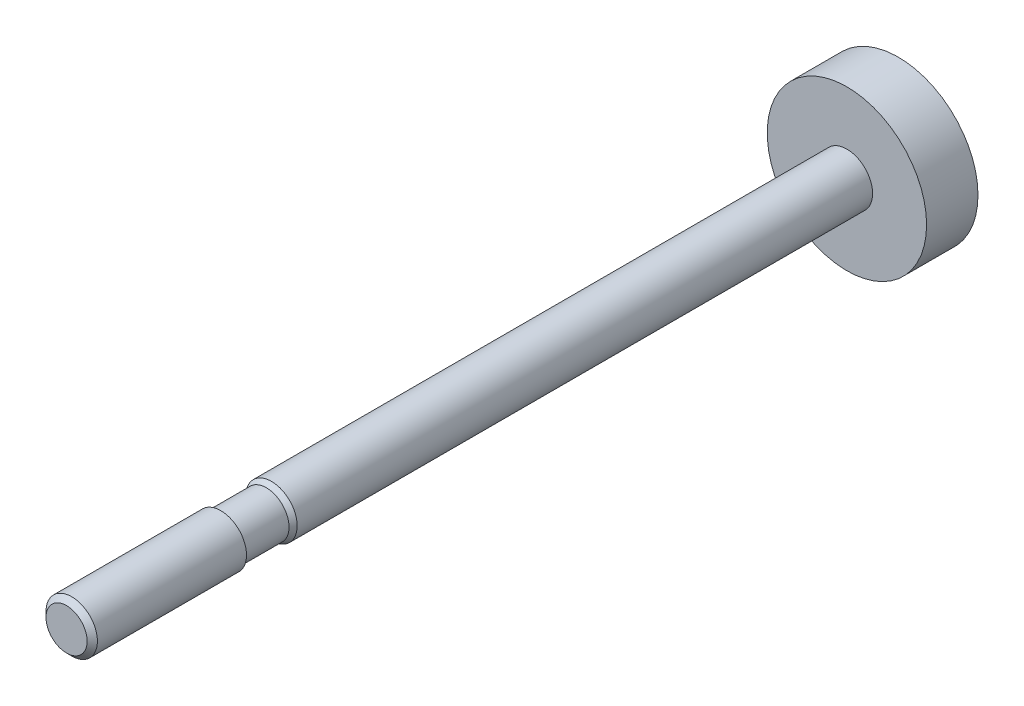
ISO-10303-21;
HEADER;
FILE_DESCRIPTION(('STEP AP214'),'2;1');
FILE_NAME('part.step','',(''),(''),'','','');
FILE_SCHEMA(('AUTOMOTIVE_DESIGN { 1 0 10303 214 1 1 1 1 }'));
ENDSEC;
DATA;
#1=APPLICATION_CONTEXT('core data for automotive mechanical design processes');
#2=APPLICATION_PROTOCOL_DEFINITION('international standard','automotive_design',2000,#1);
#3=PRODUCT_CONTEXT('',#1,'mechanical');
#4=PRODUCT('Part','Part','',(#3));
#5=PRODUCT_RELATED_PRODUCT_CATEGORY('part','',(#4));
#6=PRODUCT_DEFINITION_FORMATION('','',#4);
#7=PRODUCT_DEFINITION_CONTEXT('part definition',#1,'design');
#8=PRODUCT_DEFINITION('design','',#6,#7);
#9=PRODUCT_DEFINITION_SHAPE('','',#8);
#10=(LENGTH_UNIT() NAMED_UNIT(*) SI_UNIT(.MILLI.,.METRE.));
#11=(NAMED_UNIT(*) PLANE_ANGLE_UNIT() SI_UNIT($,.RADIAN.));
#12=(NAMED_UNIT(*) SI_UNIT($,.STERADIAN.) SOLID_ANGLE_UNIT());
#13=UNCERTAINTY_MEASURE_WITH_UNIT(LENGTH_MEASURE(1.E-05),#10,'distance_accuracy_value','');
#14=(GEOMETRIC_REPRESENTATION_CONTEXT(3) GLOBAL_UNCERTAINTY_ASSIGNED_CONTEXT((#13)) GLOBAL_UNIT_ASSIGNED_CONTEXT((#10,
#11,#12)) REPRESENTATION_CONTEXT('',''));
#15=CARTESIAN_POINT('',(0.,0.,0.));
#16=DIRECTION('',(0.,0.,1.));
#17=DIRECTION('',(1.,0.,0.));
#18=AXIS2_PLACEMENT_3D('',#15,#16,#17);
#19=CARTESIAN_POINT('',(0.,0.,2.5));
#20=DIRECTION('',(0.,0.,1.));
#21=DIRECTION('',(1.,0.,0.));
#22=AXIS2_PLACEMENT_3D('',#19,#20,#21);
#23=PLANE('',#22);
#24=CARTESIAN_POINT('',(0.,0.,2.5));
#25=DIRECTION('',(0.,0.,1.));
#26=DIRECTION('',(1.,0.,0.));
#27=AXIS2_PLACEMENT_3D('',#24,#25,#26);
#28=CIRCLE('',#27,7.75);
#29=CARTESIAN_POINT('',(7.75,0.,2.5));
#30=VERTEX_POINT('',#29);
#31=EDGE_CURVE('E56',#30,#30,#28,.T.);
#32=ORIENTED_EDGE('',*,*,#31,.T.);
#33=EDGE_LOOP('',(#32));
#34=FACE_BOUND('',#33,.T.);
#35=CARTESIAN_POINT('',(0.,0.,2.5));
#36=DIRECTION('',(0.,0.,1.));
#37=DIRECTION('',(1.,0.,0.));
#38=AXIS2_PLACEMENT_3D('',#35,#36,#37);
#39=CIRCLE('',#38,2.5);
#40=CARTESIAN_POINT('',(2.5,0.,2.5));
#41=VERTEX_POINT('',#40);
#42=EDGE_CURVE('E57',#41,#41,#39,.F.);
#43=ORIENTED_EDGE('',*,*,#42,.T.);
#44=EDGE_LOOP('',(#43));
#45=FACE_BOUND('',#44,.T.);
#46=ADVANCED_FACE('F36',(#34,#45),#23,.T.);
#47=CARTESIAN_POINT('',(0.,0.,2.5));
#48=DIRECTION('',(0.,0.,-1.));
#49=DIRECTION('',(-1.,0.,0.));
#50=AXIS2_PLACEMENT_3D('',#47,#48,#49);
#51=CYLINDRICAL_SURFACE('',#50,7.75);
#52=ORIENTED_EDGE('',*,*,#31,.F.);
#53=EDGE_LOOP('',(#52));
#54=FACE_BOUND('',#53,.T.);
#55=CARTESIAN_POINT('',(0.,0.,-2.5));
#56=DIRECTION('',(0.,0.,1.));
#57=DIRECTION('',(1.,0.,0.));
#58=AXIS2_PLACEMENT_3D('',#55,#56,#57);
#59=CIRCLE('',#58,7.75);
#60=CARTESIAN_POINT('',(7.74999999999999,0.,-2.5));
#61=VERTEX_POINT('',#60);
#62=EDGE_CURVE('E60',#61,#61,#59,.T.);
#63=ORIENTED_EDGE('',*,*,#62,.T.);
#64=EDGE_LOOP('',(#63));
#65=FACE_BOUND('',#64,.T.);
#66=ADVANCED_FACE('F38',(#54,#65),#51,.T.);
#67=CARTESIAN_POINT('',(0.,0.,-2.5));
#68=DIRECTION('',(0.,0.,1.));
#69=DIRECTION('',(1.,0.,0.));
#70=AXIS2_PLACEMENT_3D('',#67,#68,#69);
#71=PLANE('',#70);
#72=ORIENTED_EDGE('',*,*,#62,.F.);
#73=EDGE_LOOP('',(#72));
#74=FACE_BOUND('',#73,.T.);
#75=ADVANCED_FACE('F94',(#74),#71,.F.);
#76=CARTESIAN_POINT('',(0.,0.,58.97));
#77=DIRECTION('',(0.,0.,-1.));
#78=DIRECTION('',(-1.,0.,0.));
#79=AXIS2_PLACEMENT_3D('',#76,#77,#78);
#80=CYLINDRICAL_SURFACE('',#79,2.5);
#81=CARTESIAN_POINT('',(0.,0.,58.47));
#82=DIRECTION('',(0.,0.,1.));
#83=DIRECTION('',(1.,0.,0.));
#84=AXIS2_PLACEMENT_3D('',#81,#82,#83);
#85=CIRCLE('',#84,2.5);
#86=CARTESIAN_POINT('',(2.5,0.,58.47));
#87=VERTEX_POINT('',#86);
#88=EDGE_CURVE('E47',#87,#87,#85,.F.);
#89=ORIENTED_EDGE('',*,*,#88,.T.);
#90=EDGE_LOOP('',(#89));
#91=FACE_BOUND('',#90,.T.);
#92=ORIENTED_EDGE('',*,*,#42,.F.);
#93=EDGE_LOOP('',(#92));
#94=FACE_BOUND('',#93,.T.);
#95=ADVANCED_FACE('F88',(#91,#94),#80,.T.);
#96=CARTESIAN_POINT('',(0.,0.,58.97));
#97=DIRECTION('',(0.,0.,-1.));
#98=DIRECTION('',(-1.,0.,0.));
#99=AXIS2_PLACEMENT_3D('',#96,#97,#98);
#100=CONICAL_SURFACE('',#99,2.21132486540519,0.523598775598293);
#101=ORIENTED_EDGE('',*,*,#88,.F.);
#102=EDGE_LOOP('',(#101));
#103=FACE_BOUND('',#102,.T.);
#104=CARTESIAN_POINT('',(0.,0.,58.97));
#105=DIRECTION('',(0.,0.,1.));
#106=DIRECTION('',(1.,0.,0.));
#107=AXIS2_PLACEMENT_3D('',#104,#105,#106);
#108=CIRCLE('',#107,2.21132486540519);
#109=CARTESIAN_POINT('',(2.21132486540519,0.,58.97));
#110=VERTEX_POINT('',#109);
#111=EDGE_CURVE('E51',#110,#110,#108,.T.);
#112=ORIENTED_EDGE('',*,*,#111,.F.);
#113=EDGE_LOOP('',(#112));
#114=FACE_BOUND('',#113,.T.);
#115=ADVANCED_FACE('F83',(#103,#114),#100,.T.);
#116=CARTESIAN_POINT('',(0.,0.,63.4));
#117=DIRECTION('',(0.,0.,-1.));
#118=DIRECTION('',(-1.,0.,0.));
#119=AXIS2_PLACEMENT_3D('',#116,#117,#118);
#120=CYLINDRICAL_SURFACE('',#119,2.21132486540518);
#121=CARTESIAN_POINT('',(0.,0.,63.4));
#122=DIRECTION('',(0.,0.,1.));
#123=DIRECTION('',(1.,0.,0.));
#124=AXIS2_PLACEMENT_3D('',#121,#122,#123);
#125=CIRCLE('',#124,2.21132486540518);
#126=CARTESIAN_POINT('',(2.21132486540518,0.,63.4));
#127=VERTEX_POINT('',#126);
#128=EDGE_CURVE('E61',#127,#127,#125,.T.);
#129=ORIENTED_EDGE('',*,*,#128,.F.);
#130=EDGE_LOOP('',(#129));
#131=FACE_BOUND('',#130,.T.);
#132=ORIENTED_EDGE('',*,*,#111,.T.);
#133=EDGE_LOOP('',(#132));
#134=FACE_BOUND('',#133,.T.);
#135=ADVANCED_FACE('F77',(#131,#134),#120,.T.);
#136=CARTESIAN_POINT('',(0.,0.,63.4));
#137=DIRECTION('',(0.,0.,1.));
#138=DIRECTION('',(1.,0.,0.));
#139=AXIS2_PLACEMENT_3D('',#136,#137,#138);
#140=PLANE('',#139);
#141=CARTESIAN_POINT('',(0.,0.,63.4));
#142=DIRECTION('',(0.,0.,1.));
#143=DIRECTION('',(1.,0.,0.));
#144=AXIS2_PLACEMENT_3D('',#141,#142,#143);
#145=CIRCLE('',#144,2.5);
#146=CARTESIAN_POINT('',(2.5,0.,63.4));
#147=VERTEX_POINT('',#146);
#148=EDGE_CURVE('E68',#147,#147,#145,.T.);
#149=ORIENTED_EDGE('',*,*,#148,.F.);
#150=EDGE_LOOP('',(#149));
#151=FACE_BOUND('',#150,.T.);
#152=ORIENTED_EDGE('',*,*,#128,.T.);
#153=EDGE_LOOP('',(#152));
#154=FACE_BOUND('',#153,.T.);
#155=ADVANCED_FACE('F74',(#151,#154),#140,.F.);
#156=CARTESIAN_POINT('',(0.,0.,78.4));
#157=DIRECTION('',(0.,0.,-1.));
#158=DIRECTION('',(-1.,0.,0.));
#159=AXIS2_PLACEMENT_3D('',#156,#157,#158);
#160=CYLINDRICAL_SURFACE('',#159,2.5);
#161=CARTESIAN_POINT('',(0.,0.,77.9));
#162=DIRECTION('',(0.,0.,1.));
#163=DIRECTION('',(1.,0.,0.));
#164=AXIS2_PLACEMENT_3D('',#161,#162,#163);
#165=CIRCLE('',#164,2.5);
#166=CARTESIAN_POINT('',(2.5,0.,77.9));
#167=VERTEX_POINT('',#166);
#168=EDGE_CURVE('E10',#167,#167,#165,.F.);
#169=ORIENTED_EDGE('',*,*,#168,.T.);
#170=EDGE_LOOP('',(#169));
#171=FACE_BOUND('',#170,.T.);
#172=ORIENTED_EDGE('',*,*,#148,.T.);
#173=EDGE_LOOP('',(#172));
#174=FACE_BOUND('',#173,.T.);
#175=ADVANCED_FACE('F72',(#171,#174),#160,.T.);
#176=CARTESIAN_POINT('',(0.,0.,78.4));
#177=DIRECTION('',(0.,0.,1.));
#178=DIRECTION('',(1.,0.,0.));
#179=AXIS2_PLACEMENT_3D('',#176,#177,#178);
#180=PLANE('',#179);
#181=CARTESIAN_POINT('',(0.,0.,78.4));
#182=DIRECTION('',(0.,0.,1.));
#183=DIRECTION('',(1.,0.,0.));
#184=AXIS2_PLACEMENT_3D('',#181,#182,#183);
#185=CIRCLE('',#184,2.);
#186=CARTESIAN_POINT('',(2.,0.,78.4));
#187=VERTEX_POINT('',#186);
#188=EDGE_CURVE('E43',#187,#187,#185,.T.);
#189=ORIENTED_EDGE('',*,*,#188,.T.);
#190=EDGE_LOOP('',(#189));
#191=FACE_BOUND('',#190,.T.);
#192=ADVANCED_FACE('F126',(#191),#180,.T.);
#193=CARTESIAN_POINT('',(0.,0.,78.4));
#194=DIRECTION('',(0.,0.,-1.));
#195=DIRECTION('',(-1.,0.,0.));
#196=AXIS2_PLACEMENT_3D('',#193,#194,#195);
#197=CONICAL_SURFACE('',#196,2.,0.785398163397448);
#198=ORIENTED_EDGE('',*,*,#168,.F.);
#199=EDGE_LOOP('',(#198));
#200=FACE_BOUND('',#199,.T.);
#201=ORIENTED_EDGE('',*,*,#188,.F.);
#202=EDGE_LOOP('',(#201));
#203=FACE_BOUND('',#202,.T.);
#204=ADVANCED_FACE('F137',(#200,#203),#197,.T.);
#205=CLOSED_SHELL('',(#46,#66,#75,#95,#115,#135,#155,#175,#192,#204));
#206=MANIFOLD_SOLID_BREP('B2',#205);
#207=ADVANCED_BREP_SHAPE_REPRESENTATION('',(#18,#206),#14);
#208=SHAPE_DEFINITION_REPRESENTATION(#9,#207);
ENDSEC;
END-ISO-10303-21;
